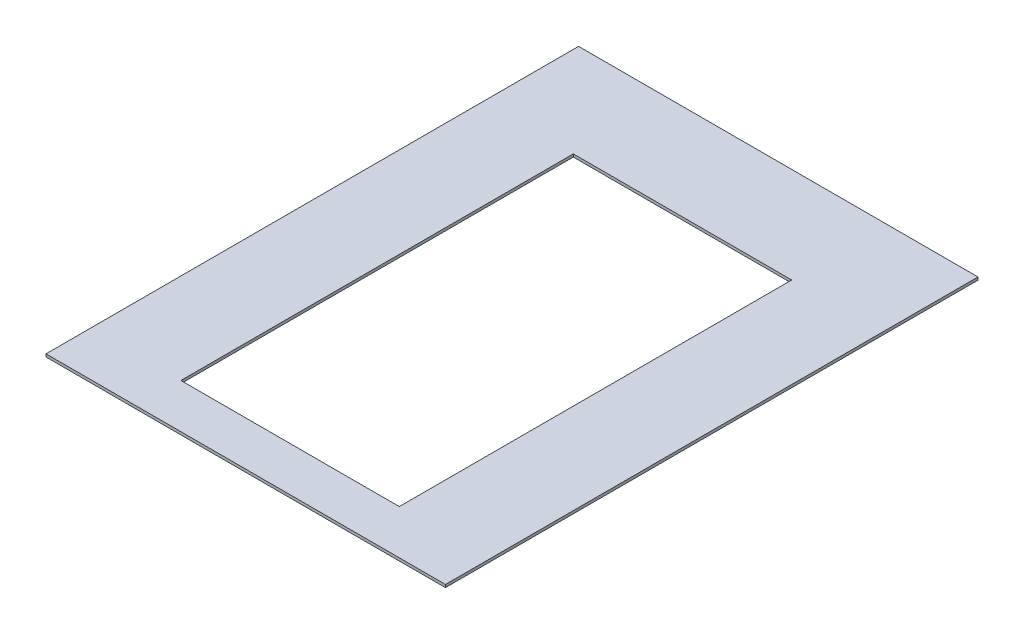
ISO-10303-21;
HEADER;
FILE_DESCRIPTION(('STEP AP214'),'2;1');
FILE_NAME('part.step','',(''),(''),'','','');
FILE_SCHEMA(('AUTOMOTIVE_DESIGN { 1 0 10303 214 1 1 1 1 }'));
ENDSEC;
DATA;
#1=APPLICATION_CONTEXT('core data for automotive mechanical design processes');
#2=APPLICATION_PROTOCOL_DEFINITION('international standard','automotive_design',2000,#1);
#3=PRODUCT_CONTEXT('',#1,'mechanical');
#4=PRODUCT('Part','Part','',(#3));
#5=PRODUCT_RELATED_PRODUCT_CATEGORY('part','',(#4));
#6=PRODUCT_DEFINITION_FORMATION('','',#4);
#7=PRODUCT_DEFINITION_CONTEXT('part definition',#1,'design');
#8=PRODUCT_DEFINITION('design','',#6,#7);
#9=PRODUCT_DEFINITION_SHAPE('','',#8);
#10=(LENGTH_UNIT() NAMED_UNIT(*) SI_UNIT(.MILLI.,.METRE.));
#11=(NAMED_UNIT(*) PLANE_ANGLE_UNIT() SI_UNIT($,.RADIAN.));
#12=(NAMED_UNIT(*) SI_UNIT($,.STERADIAN.) SOLID_ANGLE_UNIT());
#13=UNCERTAINTY_MEASURE_WITH_UNIT(LENGTH_MEASURE(1.E-05),#10,'distance_accuracy_value','');
#14=(GEOMETRIC_REPRESENTATION_CONTEXT(3) GLOBAL_UNCERTAINTY_ASSIGNED_CONTEXT((#13)) GLOBAL_UNIT_ASSIGNED_CONTEXT((#10,
#11,#12)) REPRESENTATION_CONTEXT('',''));
#15=CARTESIAN_POINT('',(0.,0.,0.));
#16=DIRECTION('',(0.,0.,1.));
#17=DIRECTION('',(1.,0.,0.));
#18=AXIS2_PLACEMENT_3D('',#15,#16,#17);
#19=CARTESIAN_POINT('',(0.,1.5875,0.));
#20=DIRECTION('',(0.,-1.,0.));
#21=DIRECTION('',(0.,0.,-1.));
#22=AXIS2_PLACEMENT_3D('',#19,#20,#21);
#23=PLANE('',#22);
#24=DIRECTION('',(0.,0.,-1.));
#25=VECTOR('',#24,1.);
#26=CARTESIAN_POINT('',(228.6,1.5875,304.8));
#27=LINE('',#26,#25);
#28=CARTESIAN_POINT('',(228.6,1.5875,304.8));
#29=VERTEX_POINT('',#28);
#30=CARTESIAN_POINT('',(228.6,1.5875,-304.8));
#31=VERTEX_POINT('',#30);
#32=EDGE_CURVE('E157',#29,#31,#27,.T.);
#33=ORIENTED_EDGE('',*,*,#32,.T.);
#34=DIRECTION('',(-1.,0.,0.));
#35=VECTOR('',#34,1.);
#36=CARTESIAN_POINT('',(-228.6,1.5875,-304.8));
#37=LINE('',#36,#35);
#38=CARTESIAN_POINT('',(-228.6,1.5875,-304.8));
#39=VERTEX_POINT('',#38);
#40=EDGE_CURVE('E161',#31,#39,#37,.T.);
#41=ORIENTED_EDGE('',*,*,#40,.T.);
#42=DIRECTION('',(0.,0.,1.));
#43=VECTOR('',#42,1.);
#44=CARTESIAN_POINT('',(-228.6,1.5875,304.8));
#45=LINE('',#44,#43);
#46=CARTESIAN_POINT('',(-228.6,1.5875,304.8));
#47=VERTEX_POINT('',#46);
#48=EDGE_CURVE('E165',#39,#47,#45,.T.);
#49=ORIENTED_EDGE('',*,*,#48,.T.);
#50=DIRECTION('',(1.,0.,0.));
#51=VECTOR('',#50,1.);
#52=CARTESIAN_POINT('',(-228.6,1.5875,304.8));
#53=LINE('',#52,#51);
#54=EDGE_CURVE('E168',#47,#29,#53,.T.);
#55=ORIENTED_EDGE('',*,*,#54,.T.);
#56=EDGE_LOOP('',(#33,#41,#49,#55));
#57=FACE_BOUND('',#56,.T.);
#58=DIRECTION('',(0.,0.,1.));
#59=VECTOR('',#58,1.);
#60=CARTESIAN_POINT('',(-125.,1.5875,-195.2));
#61=LINE('',#60,#59);
#62=CARTESIAN_POINT('',(-125.,1.5875,-195.2));
#63=VERTEX_POINT('',#62);
#64=CARTESIAN_POINT('',(-125.,1.5875,254.));
#65=VERTEX_POINT('',#64);
#66=EDGE_CURVE('E109',#63,#65,#61,.T.);
#67=ORIENTED_EDGE('',*,*,#66,.F.);
#68=DIRECTION('',(-1.,0.,0.));
#69=VECTOR('',#68,1.);
#70=CARTESIAN_POINT('',(-125.,1.5875,-195.2));
#71=LINE('',#70,#69);
#72=CARTESIAN_POINT('',(125.,1.5875,-195.2));
#73=VERTEX_POINT('',#72);
#74=EDGE_CURVE('E135',#73,#63,#71,.T.);
#75=ORIENTED_EDGE('',*,*,#74,.F.);
#76=DIRECTION('',(0.,0.,-1.));
#77=VECTOR('',#76,1.);
#78=CARTESIAN_POINT('',(125.,1.5875,-195.2));
#79=LINE('',#78,#77);
#80=CARTESIAN_POINT('',(125.,1.5875,254.));
#81=VERTEX_POINT('',#80);
#82=EDGE_CURVE('E131',#81,#73,#79,.T.);
#83=ORIENTED_EDGE('',*,*,#82,.F.);
#84=DIRECTION('',(1.,0.,0.));
#85=VECTOR('',#84,1.);
#86=CARTESIAN_POINT('',(-125.,1.5875,254.));
#87=LINE('',#86,#85);
#88=EDGE_CURVE('E118',#65,#81,#87,.T.);
#89=ORIENTED_EDGE('',*,*,#88,.F.);
#90=EDGE_LOOP('',(#67,#75,#83,#89));
#91=FACE_BOUND('',#90,.T.);
#92=ADVANCED_FACE('F43',(#57,#91),#23,.F.);
#93=CARTESIAN_POINT('',(0.,-1.5875,0.));
#94=DIRECTION('',(0.,-1.,0.));
#95=DIRECTION('',(0.,0.,-1.));
#96=AXIS2_PLACEMENT_3D('',#93,#94,#95);
#97=PLANE('',#96);
#98=DIRECTION('',(0.,0.,-1.));
#99=VECTOR('',#98,1.);
#100=CARTESIAN_POINT('',(228.6,-1.5875,304.8));
#101=LINE('',#100,#99);
#102=CARTESIAN_POINT('',(228.6,-1.5875,304.8));
#103=VERTEX_POINT('',#102);
#104=CARTESIAN_POINT('',(228.6,-1.5875,-304.8));
#105=VERTEX_POINT('',#104);
#106=EDGE_CURVE('E127',#103,#105,#101,.T.);
#107=ORIENTED_EDGE('',*,*,#106,.F.);
#108=DIRECTION('',(1.,0.,0.));
#109=VECTOR('',#108,1.);
#110=CARTESIAN_POINT('',(-228.6,-1.5875,304.8));
#111=LINE('',#110,#109);
#112=CARTESIAN_POINT('',(-228.6,-1.5875,304.8));
#113=VERTEX_POINT('',#112);
#114=EDGE_CURVE('E162',#113,#103,#111,.T.);
#115=ORIENTED_EDGE('',*,*,#114,.F.);
#116=DIRECTION('',(0.,0.,1.));
#117=VECTOR('',#116,1.);
#118=CARTESIAN_POINT('',(-228.6,-1.5875,304.8));
#119=LINE('',#118,#117);
#120=CARTESIAN_POINT('',(-228.6,-1.5875,-304.8));
#121=VERTEX_POINT('',#120);
#122=EDGE_CURVE('E178',#121,#113,#119,.T.);
#123=ORIENTED_EDGE('',*,*,#122,.F.);
#124=DIRECTION('',(-1.,0.,0.));
#125=VECTOR('',#124,1.);
#126=CARTESIAN_POINT('',(-228.6,-1.5875,-304.8));
#127=LINE('',#126,#125);
#128=EDGE_CURVE('E175',#105,#121,#127,.T.);
#129=ORIENTED_EDGE('',*,*,#128,.F.);
#130=EDGE_LOOP('',(#107,#115,#123,#129));
#131=FACE_BOUND('',#130,.T.);
#132=DIRECTION('',(-1.,0.,0.));
#133=VECTOR('',#132,1.);
#134=CARTESIAN_POINT('',(-125.,-1.5875,-195.2));
#135=LINE('',#134,#133);
#136=CARTESIAN_POINT('',(125.,-1.5875,-195.2));
#137=VERTEX_POINT('',#136);
#138=CARTESIAN_POINT('',(-125.,-1.5875,-195.2));
#139=VERTEX_POINT('',#138);
#140=EDGE_CURVE('E119',#137,#139,#135,.T.);
#141=ORIENTED_EDGE('',*,*,#140,.T.);
#142=DIRECTION('',(0.,0.,1.));
#143=VECTOR('',#142,1.);
#144=CARTESIAN_POINT('',(-125.,-1.5875,-195.2));
#145=LINE('',#144,#143);
#146=CARTESIAN_POINT('',(-125.,-1.5875,254.));
#147=VERTEX_POINT('',#146);
#148=EDGE_CURVE('E67',#139,#147,#145,.T.);
#149=ORIENTED_EDGE('',*,*,#148,.T.);
#150=DIRECTION('',(1.,0.,0.));
#151=VECTOR('',#150,1.);
#152=CARTESIAN_POINT('',(-125.,-1.5875,254.));
#153=LINE('',#152,#151);
#154=CARTESIAN_POINT('',(125.,-1.5875,254.));
#155=VERTEX_POINT('',#154);
#156=EDGE_CURVE('E125',#147,#155,#153,.T.);
#157=ORIENTED_EDGE('',*,*,#156,.T.);
#158=DIRECTION('',(0.,0.,-1.));
#159=VECTOR('',#158,1.);
#160=CARTESIAN_POINT('',(125.,-1.5875,-195.2));
#161=LINE('',#160,#159);
#162=EDGE_CURVE('E144',#155,#137,#161,.T.);
#163=ORIENTED_EDGE('',*,*,#162,.T.);
#164=EDGE_LOOP('',(#141,#149,#157,#163));
#165=FACE_BOUND('',#164,.T.);
#166=ADVANCED_FACE('F201',(#131,#165),#97,.T.);
#167=CARTESIAN_POINT('',(228.6,1.5875,304.8));
#168=DIRECTION('',(-1.,0.,0.));
#169=DIRECTION('',(0.,0.,1.));
#170=AXIS2_PLACEMENT_3D('',#167,#168,#169);
#171=PLANE('',#170);
#172=ORIENTED_EDGE('',*,*,#106,.T.);
#173=DIRECTION('',(0.,-1.,0.));
#174=VECTOR('',#173,1.);
#175=CARTESIAN_POINT('',(228.6,1.5875,-304.8));
#176=LINE('',#175,#174);
#177=EDGE_CURVE('E11',#31,#105,#176,.T.);
#178=ORIENTED_EDGE('',*,*,#177,.F.);
#179=ORIENTED_EDGE('',*,*,#32,.F.);
#180=DIRECTION('',(0.,-1.,0.));
#181=VECTOR('',#180,1.);
#182=CARTESIAN_POINT('',(228.6,1.5875,304.8));
#183=LINE('',#182,#181);
#184=EDGE_CURVE('E171',#29,#103,#183,.T.);
#185=ORIENTED_EDGE('',*,*,#184,.T.);
#186=EDGE_LOOP('',(#172,#178,#179,#185));
#187=FACE_BOUND('',#186,.T.);
#188=ADVANCED_FACE('F45',(#187),#171,.F.);
#189=CARTESIAN_POINT('',(-228.6,1.5875,-304.8));
#190=DIRECTION('',(0.,0.,1.));
#191=DIRECTION('',(1.,0.,0.));
#192=AXIS2_PLACEMENT_3D('',#189,#190,#191);
#193=PLANE('',#192);
#194=ORIENTED_EDGE('',*,*,#128,.T.);
#195=DIRECTION('',(0.,-1.,0.));
#196=VECTOR('',#195,1.);
#197=CARTESIAN_POINT('',(-228.6,1.5875,-304.8));
#198=LINE('',#197,#196);
#199=EDGE_CURVE('E52',#39,#121,#198,.T.);
#200=ORIENTED_EDGE('',*,*,#199,.F.);
#201=ORIENTED_EDGE('',*,*,#40,.F.);
#202=ORIENTED_EDGE('',*,*,#177,.T.);
#203=EDGE_LOOP('',(#194,#200,#201,#202));
#204=FACE_BOUND('',#203,.T.);
#205=ADVANCED_FACE('F211',(#204),#193,.F.);
#206=CARTESIAN_POINT('',(-228.6,1.5875,304.8));
#207=DIRECTION('',(1.,0.,0.));
#208=DIRECTION('',(0.,0.,-1.));
#209=AXIS2_PLACEMENT_3D('',#206,#207,#208);
#210=PLANE('',#209);
#211=ORIENTED_EDGE('',*,*,#122,.T.);
#212=DIRECTION('',(0.,-1.,0.));
#213=VECTOR('',#212,1.);
#214=CARTESIAN_POINT('',(-228.6,1.5875,304.8));
#215=LINE('',#214,#213);
#216=EDGE_CURVE('E186',#47,#113,#215,.T.);
#217=ORIENTED_EDGE('',*,*,#216,.F.);
#218=ORIENTED_EDGE('',*,*,#48,.F.);
#219=ORIENTED_EDGE('',*,*,#199,.T.);
#220=EDGE_LOOP('',(#211,#217,#218,#219));
#221=FACE_BOUND('',#220,.T.);
#222=ADVANCED_FACE('F195',(#221),#210,.F.);
#223=CARTESIAN_POINT('',(-228.6,1.5875,304.8));
#224=DIRECTION('',(0.,0.,-1.));
#225=DIRECTION('',(-1.,0.,0.));
#226=AXIS2_PLACEMENT_3D('',#223,#224,#225);
#227=PLANE('',#226);
#228=ORIENTED_EDGE('',*,*,#114,.T.);
#229=ORIENTED_EDGE('',*,*,#184,.F.);
#230=ORIENTED_EDGE('',*,*,#54,.F.);
#231=ORIENTED_EDGE('',*,*,#216,.T.);
#232=EDGE_LOOP('',(#228,#229,#230,#231));
#233=FACE_BOUND('',#232,.T.);
#234=ADVANCED_FACE('F205',(#233),#227,.F.);
#235=CARTESIAN_POINT('',(-125.,1.5875,-195.2));
#236=DIRECTION('',(1.,0.,0.));
#237=DIRECTION('',(0.,0.,-1.));
#238=AXIS2_PLACEMENT_3D('',#235,#236,#237);
#239=PLANE('',#238);
#240=ORIENTED_EDGE('',*,*,#148,.F.);
#241=DIRECTION('',(0.,-1.,0.));
#242=VECTOR('',#241,1.);
#243=CARTESIAN_POINT('',(-125.,1.5875,-195.2));
#244=LINE('',#243,#242);
#245=EDGE_CURVE('E113',#63,#139,#244,.T.);
#246=ORIENTED_EDGE('',*,*,#245,.F.);
#247=ORIENTED_EDGE('',*,*,#66,.T.);
#248=DIRECTION('',(0.,-1.,0.));
#249=VECTOR('',#248,1.);
#250=CARTESIAN_POINT('',(-125.,1.5875,254.));
#251=LINE('',#250,#249);
#252=EDGE_CURVE('E112',#65,#147,#251,.T.);
#253=ORIENTED_EDGE('',*,*,#252,.T.);
#254=EDGE_LOOP('',(#240,#246,#247,#253));
#255=FACE_BOUND('',#254,.T.);
#256=ADVANCED_FACE('F111',(#255),#239,.T.);
#257=CARTESIAN_POINT('',(-125.,1.5875,254.));
#258=DIRECTION('',(0.,0.,-1.));
#259=DIRECTION('',(-1.,0.,0.));
#260=AXIS2_PLACEMENT_3D('',#257,#258,#259);
#261=PLANE('',#260);
#262=ORIENTED_EDGE('',*,*,#156,.F.);
#263=ORIENTED_EDGE('',*,*,#252,.F.);
#264=ORIENTED_EDGE('',*,*,#88,.T.);
#265=DIRECTION('',(0.,-1.,0.));
#266=VECTOR('',#265,1.);
#267=CARTESIAN_POINT('',(125.,1.5875,254.));
#268=LINE('',#267,#266);
#269=EDGE_CURVE('E128',#81,#155,#268,.T.);
#270=ORIENTED_EDGE('',*,*,#269,.T.);
#271=EDGE_LOOP('',(#262,#263,#264,#270));
#272=FACE_BOUND('',#271,.T.);
#273=ADVANCED_FACE('F122',(#272),#261,.T.);
#274=CARTESIAN_POINT('',(125.,1.5875,-195.2));
#275=DIRECTION('',(-1.,0.,0.));
#276=DIRECTION('',(0.,0.,1.));
#277=AXIS2_PLACEMENT_3D('',#274,#275,#276);
#278=PLANE('',#277);
#279=ORIENTED_EDGE('',*,*,#162,.F.);
#280=ORIENTED_EDGE('',*,*,#269,.F.);
#281=ORIENTED_EDGE('',*,*,#82,.T.);
#282=DIRECTION('',(0.,-1.,0.));
#283=VECTOR('',#282,1.);
#284=CARTESIAN_POINT('',(125.,1.5875,-195.2));
#285=LINE('',#284,#283);
#286=EDGE_CURVE('E59',#73,#137,#285,.T.);
#287=ORIENTED_EDGE('',*,*,#286,.T.);
#288=EDGE_LOOP('',(#279,#280,#281,#287));
#289=FACE_BOUND('',#288,.T.);
#290=ADVANCED_FACE('F234',(#289),#278,.T.);
#291=CARTESIAN_POINT('',(-125.,1.5875,-195.2));
#292=DIRECTION('',(0.,0.,1.));
#293=DIRECTION('',(1.,0.,0.));
#294=AXIS2_PLACEMENT_3D('',#291,#292,#293);
#295=PLANE('',#294);
#296=ORIENTED_EDGE('',*,*,#140,.F.);
#297=ORIENTED_EDGE('',*,*,#286,.F.);
#298=ORIENTED_EDGE('',*,*,#74,.T.);
#299=ORIENTED_EDGE('',*,*,#245,.T.);
#300=EDGE_LOOP('',(#296,#297,#298,#299));
#301=FACE_BOUND('',#300,.T.);
#302=ADVANCED_FACE('F238',(#301),#295,.T.);
#303=CLOSED_SHELL('',(#92,#166,#188,#205,#222,#234,#256,#273,#290,#302));
#304=MANIFOLD_SOLID_BREP('B2',#303);
#305=ADVANCED_BREP_SHAPE_REPRESENTATION('',(#18,#304),#14);
#306=SHAPE_DEFINITION_REPRESENTATION(#9,#305);
ENDSEC;
END-ISO-10303-21;
